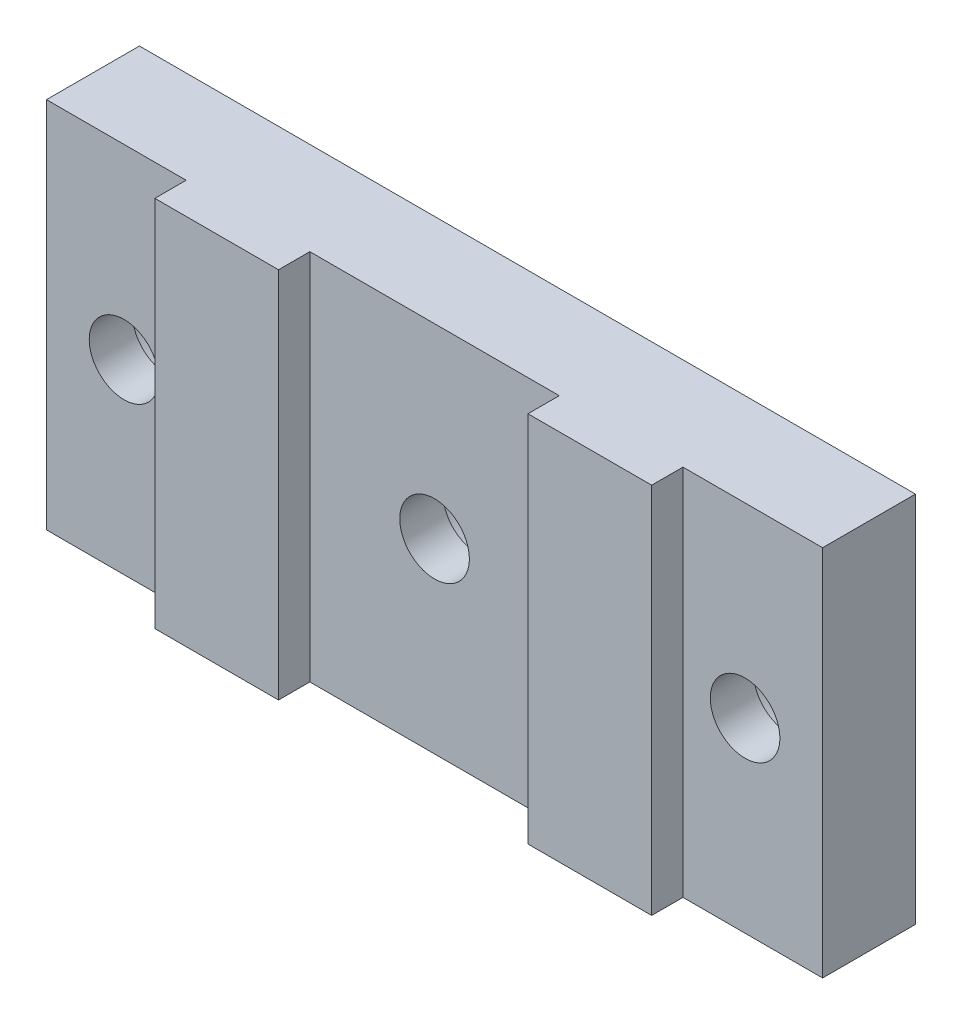
ISO-10303-21;
HEADER;
FILE_DESCRIPTION(('STEP AP214'),'2;1');
FILE_NAME('part.step','',(''),(''),'','','');
FILE_SCHEMA(('AUTOMOTIVE_DESIGN { 1 0 10303 214 1 1 1 1 }'));
ENDSEC;
DATA;
#1=APPLICATION_CONTEXT('core data for automotive mechanical design processes');
#2=APPLICATION_PROTOCOL_DEFINITION('international standard','automotive_design',2000,#1);
#3=PRODUCT_CONTEXT('',#1,'mechanical');
#4=PRODUCT('Part','Part','',(#3));
#5=PRODUCT_RELATED_PRODUCT_CATEGORY('part','',(#4));
#6=PRODUCT_DEFINITION_FORMATION('','',#4);
#7=PRODUCT_DEFINITION_CONTEXT('part definition',#1,'design');
#8=PRODUCT_DEFINITION('design','',#6,#7);
#9=PRODUCT_DEFINITION_SHAPE('','',#8);
#10=(LENGTH_UNIT() NAMED_UNIT(*) SI_UNIT(.MILLI.,.METRE.));
#11=(NAMED_UNIT(*) PLANE_ANGLE_UNIT() SI_UNIT($,.RADIAN.));
#12=(NAMED_UNIT(*) SI_UNIT($,.STERADIAN.) SOLID_ANGLE_UNIT());
#13=UNCERTAINTY_MEASURE_WITH_UNIT(LENGTH_MEASURE(1.E-05),#10,'distance_accuracy_value','');
#14=(GEOMETRIC_REPRESENTATION_CONTEXT(3) GLOBAL_UNCERTAINTY_ASSIGNED_CONTEXT((#13)) GLOBAL_UNIT_ASSIGNED_CONTEXT((#10,
#11,#12)) REPRESENTATION_CONTEXT('',''));
#15=CARTESIAN_POINT('',(0.,0.,0.));
#16=DIRECTION('',(0.,0.,1.));
#17=DIRECTION('',(1.,0.,0.));
#18=AXIS2_PLACEMENT_3D('',#15,#16,#17);
#19=CARTESIAN_POINT('',(0.,19.05,6.35));
#20=DIRECTION('',(0.,0.,-1.));
#21=DIRECTION('',(-1.,0.,0.));
#22=AXIS2_PLACEMENT_3D('',#19,#20,#21);
#23=PLANE('',#22);
#24=DIRECTION('',(1.,0.,0.));
#25=VECTOR('',#24,1.);
#26=CARTESIAN_POINT('',(0.,0.,6.35));
#27=LINE('',#26,#25);
#28=CARTESIAN_POINT('',(7.1374,0.,6.35));
#29=VERTEX_POINT('',#28);
#30=CARTESIAN_POINT('',(13.462,0.,6.35000000000003));
#31=VERTEX_POINT('',#30);
#32=EDGE_CURVE('E144',#29,#31,#27,.T.);
#33=ORIENTED_EDGE('',*,*,#32,.T.);
#34=DIRECTION('',(0.,-1.,0.));
#35=VECTOR('',#34,1.);
#36=CARTESIAN_POINT('',(13.462,19.05,6.35000000000003));
#37=LINE('',#36,#35);
#38=CARTESIAN_POINT('',(13.462,19.05,6.35000000000003));
#39=VERTEX_POINT('',#38);
#40=EDGE_CURVE('E211',#39,#31,#37,.T.);
#41=ORIENTED_EDGE('',*,*,#40,.F.);
#42=DIRECTION('',(-1.,0.,0.));
#43=VECTOR('',#42,1.);
#44=CARTESIAN_POINT('',(0.,19.05,6.35));
#45=LINE('',#44,#43);
#46=CARTESIAN_POINT('',(7.1374,19.05,6.35));
#47=VERTEX_POINT('',#46);
#48=EDGE_CURVE('E148',#39,#47,#45,.T.);
#49=ORIENTED_EDGE('',*,*,#48,.T.);
#50=DIRECTION('',(0.,-1.,0.));
#51=VECTOR('',#50,1.);
#52=CARTESIAN_POINT('',(7.1374,19.05,6.35));
#53=LINE('',#52,#51);
#54=EDGE_CURVE('E229',#47,#29,#53,.T.);
#55=ORIENTED_EDGE('',*,*,#54,.T.);
#56=EDGE_LOOP('',(#33,#41,#49,#55));
#57=FACE_BOUND('',#56,.T.);
#58=ADVANCED_FACE('F34',(#57),#23,.F.);
#59=CARTESIAN_POINT('',(0.,0.,6.35));
#60=DIRECTION('',(1.,0.,0.));
#61=DIRECTION('',(0.,0.,-1.));
#62=AXIS2_PLACEMENT_3D('',#59,#60,#61);
#63=PLANE('',#62);
#64=DIRECTION('',(0.,0.,-1.));
#65=VECTOR('',#64,1.);
#66=CARTESIAN_POINT('',(0.,0.,6.35));
#67=LINE('',#66,#65);
#68=CARTESIAN_POINT('',(0.,0.,4.7498));
#69=VERTEX_POINT('',#68);
#70=CARTESIAN_POINT('',(0.,0.,0.));
#71=VERTEX_POINT('',#70);
#72=EDGE_CURVE('E11',#69,#71,#67,.T.);
#73=ORIENTED_EDGE('',*,*,#72,.F.);
#74=DIRECTION('',(0.,-1.,0.));
#75=VECTOR('',#74,1.);
#76=CARTESIAN_POINT('',(0.,19.05,4.7498));
#77=LINE('',#76,#75);
#78=CARTESIAN_POINT('',(0.,19.05,4.7498));
#79=VERTEX_POINT('',#78);
#80=EDGE_CURVE('E228',#79,#69,#77,.T.);
#81=ORIENTED_EDGE('',*,*,#80,.F.);
#82=DIRECTION('',(0.,0.,-1.));
#83=VECTOR('',#82,1.);
#84=CARTESIAN_POINT('',(0.,19.05,6.35));
#85=LINE('',#84,#83);
#86=CARTESIAN_POINT('',(0.,19.05,0.));
#87=VERTEX_POINT('',#86);
#88=EDGE_CURVE('E156',#79,#87,#85,.T.);
#89=ORIENTED_EDGE('',*,*,#88,.T.);
#90=DIRECTION('',(0.,-1.,0.));
#91=VECTOR('',#90,1.);
#92=CARTESIAN_POINT('',(0.,0.,0.));
#93=LINE('',#92,#91);
#94=EDGE_CURVE('E232',#87,#71,#93,.T.);
#95=ORIENTED_EDGE('',*,*,#94,.T.);
#96=EDGE_LOOP('',(#73,#81,#89,#95));
#97=FACE_BOUND('',#96,.T.);
#98=ADVANCED_FACE('F36',(#97),#63,.F.);
#99=CARTESIAN_POINT('',(0.,0.,6.35));
#100=DIRECTION('',(0.,1.,0.));
#101=DIRECTION('',(0.,0.,1.));
#102=AXIS2_PLACEMENT_3D('',#99,#100,#101);
#103=PLANE('',#102);
#104=DIRECTION('',(0.,0.,-1.));
#105=VECTOR('',#104,1.);
#106=CARTESIAN_POINT('',(39.6748,0.,6.35));
#107=LINE('',#106,#105);
#108=CARTESIAN_POINT('',(39.6748,0.,4.74980000000001));
#109=VERTEX_POINT('',#108);
#110=CARTESIAN_POINT('',(39.6748,0.,0.));
#111=VERTEX_POINT('',#110);
#112=EDGE_CURVE('E43',#109,#111,#107,.T.);
#113=ORIENTED_EDGE('',*,*,#112,.F.);
#114=DIRECTION('',(1.,0.,0.));
#115=VECTOR('',#114,1.);
#116=CARTESIAN_POINT('',(39.6748,0.,4.74980000000001));
#117=LINE('',#116,#115);
#118=CARTESIAN_POINT('',(32.5374,0.,4.74980000000001));
#119=VERTEX_POINT('',#118);
#120=EDGE_CURVE('E139',#119,#109,#117,.T.);
#121=ORIENTED_EDGE('',*,*,#120,.F.);
#122=DIRECTION('',(0.,0.,-1.));
#123=VECTOR('',#122,1.);
#124=CARTESIAN_POINT('',(32.5374,0.,6.35));
#125=LINE('',#124,#123);
#126=CARTESIAN_POINT('',(32.5374,0.,6.35));
#127=VERTEX_POINT('',#126);
#128=EDGE_CURVE('E126',#127,#119,#125,.T.);
#129=ORIENTED_EDGE('',*,*,#128,.F.);
#130=CARTESIAN_POINT('',(26.2128,0.,6.35));
#131=VERTEX_POINT('',#130);
#132=EDGE_CURVE('E138',#131,#127,#27,.T.);
#133=ORIENTED_EDGE('',*,*,#132,.F.);
#134=DIRECTION('',(0.,0.,1.));
#135=VECTOR('',#134,1.);
#136=CARTESIAN_POINT('',(26.2128,0.,6.35));
#137=LINE('',#136,#135);
#138=CARTESIAN_POINT('',(26.2128,0.,4.74980000000001));
#139=VERTEX_POINT('',#138);
#140=EDGE_CURVE('E59',#139,#131,#137,.T.);
#141=ORIENTED_EDGE('',*,*,#140,.F.);
#142=DIRECTION('',(1.,0.,0.));
#143=VECTOR('',#142,1.);
#144=CARTESIAN_POINT('',(13.462,0.,4.74980000000003));
#145=LINE('',#144,#143);
#146=CARTESIAN_POINT('',(13.462,0.,4.74980000000003));
#147=VERTEX_POINT('',#146);
#148=EDGE_CURVE('E197',#147,#139,#145,.T.);
#149=ORIENTED_EDGE('',*,*,#148,.F.);
#150=DIRECTION('',(0.,0.,-1.));
#151=VECTOR('',#150,1.);
#152=CARTESIAN_POINT('',(13.462,0.,6.35000000000003));
#153=LINE('',#152,#151);
#154=EDGE_CURVE('E193',#31,#147,#153,.T.);
#155=ORIENTED_EDGE('',*,*,#154,.F.);
#156=ORIENTED_EDGE('',*,*,#32,.F.);
#157=DIRECTION('',(0.,0.,1.));
#158=VECTOR('',#157,1.);
#159=CARTESIAN_POINT('',(7.1374,0.,6.35));
#160=LINE('',#159,#158);
#161=CARTESIAN_POINT('',(7.1374,0.,4.7498));
#162=VERTEX_POINT('',#161);
#163=EDGE_CURVE('E220',#162,#29,#160,.T.);
#164=ORIENTED_EDGE('',*,*,#163,.F.);
#165=DIRECTION('',(1.,0.,0.));
#166=VECTOR('',#165,1.);
#167=CARTESIAN_POINT('',(0.,0.,4.7498));
#168=LINE('',#167,#166);
#169=EDGE_CURVE('E213',#69,#162,#168,.T.);
#170=ORIENTED_EDGE('',*,*,#169,.F.);
#171=ORIENTED_EDGE('',*,*,#72,.T.);
#172=DIRECTION('',(1.,0.,0.));
#173=VECTOR('',#172,1.);
#174=CARTESIAN_POINT('',(0.,0.,0.));
#175=LINE('',#174,#173);
#176=EDGE_CURVE('E238',#71,#111,#175,.T.);
#177=ORIENTED_EDGE('',*,*,#176,.T.);
#178=EDGE_LOOP('',(#113,#121,#129,#133,#141,#149,#155,#156,#164,#170,#171,#177));
#179=FACE_BOUND('',#178,.T.);
#180=ADVANCED_FACE('F137',(#179),#103,.F.);
#181=CARTESIAN_POINT('',(39.6748,0.,6.35));
#182=DIRECTION('',(-1.,0.,0.));
#183=DIRECTION('',(0.,0.,1.));
#184=AXIS2_PLACEMENT_3D('',#181,#182,#183);
#185=PLANE('',#184);
#186=DIRECTION('',(0.,0.,-1.));
#187=VECTOR('',#186,1.);
#188=CARTESIAN_POINT('',(39.6748,19.05,6.35));
#189=LINE('',#188,#187);
#190=CARTESIAN_POINT('',(39.6748,19.05,4.74980000000001));
#191=VERTEX_POINT('',#190);
#192=CARTESIAN_POINT('',(39.6748,19.05,0.));
#193=VERTEX_POINT('',#192);
#194=EDGE_CURVE('E158',#191,#193,#189,.T.);
#195=ORIENTED_EDGE('',*,*,#194,.F.);
#196=DIRECTION('',(0.,-1.,0.));
#197=VECTOR('',#196,1.);
#198=CARTESIAN_POINT('',(39.6748,19.05,4.74980000000001));
#199=LINE('',#198,#197);
#200=EDGE_CURVE('E190',#191,#109,#199,.T.);
#201=ORIENTED_EDGE('',*,*,#200,.T.);
#202=ORIENTED_EDGE('',*,*,#112,.T.);
#203=DIRECTION('',(0.,1.,0.));
#204=VECTOR('',#203,1.);
#205=CARTESIAN_POINT('',(39.6748,0.,0.));
#206=LINE('',#205,#204);
#207=EDGE_CURVE('E150',#111,#193,#206,.T.);
#208=ORIENTED_EDGE('',*,*,#207,.T.);
#209=EDGE_LOOP('',(#195,#201,#202,#208));
#210=FACE_BOUND('',#209,.T.);
#211=ADVANCED_FACE('F245',(#210),#185,.F.);
#212=CARTESIAN_POINT('',(0.,19.05,6.35));
#213=DIRECTION('',(0.,-1.,0.));
#214=DIRECTION('',(0.,0.,-1.));
#215=AXIS2_PLACEMENT_3D('',#212,#213,#214);
#216=PLANE('',#215);
#217=DIRECTION('',(0.,0.,-1.));
#218=VECTOR('',#217,1.);
#219=CARTESIAN_POINT('',(32.5374,19.05,6.35));
#220=LINE('',#219,#218);
#221=CARTESIAN_POINT('',(32.5374,19.05,6.35));
#222=VERTEX_POINT('',#221);
#223=CARTESIAN_POINT('',(32.5374,19.05,4.74980000000001));
#224=VERTEX_POINT('',#223);
#225=EDGE_CURVE('E51',#222,#224,#220,.T.);
#226=ORIENTED_EDGE('',*,*,#225,.T.);
#227=DIRECTION('',(1.,0.,0.));
#228=VECTOR('',#227,1.);
#229=CARTESIAN_POINT('',(39.6748,19.05,4.74980000000001));
#230=LINE('',#229,#228);
#231=EDGE_CURVE('E132',#224,#191,#230,.T.);
#232=ORIENTED_EDGE('',*,*,#231,.T.);
#233=ORIENTED_EDGE('',*,*,#194,.T.);
#234=DIRECTION('',(-1.,0.,0.));
#235=VECTOR('',#234,1.);
#236=CARTESIAN_POINT('',(0.,19.05,0.));
#237=LINE('',#236,#235);
#238=EDGE_CURVE('E145',#193,#87,#237,.T.);
#239=ORIENTED_EDGE('',*,*,#238,.T.);
#240=ORIENTED_EDGE('',*,*,#88,.F.);
#241=DIRECTION('',(1.,0.,0.));
#242=VECTOR('',#241,1.);
#243=CARTESIAN_POINT('',(0.,19.05,4.7498));
#244=LINE('',#243,#242);
#245=CARTESIAN_POINT('',(7.1374,19.05,4.7498));
#246=VERTEX_POINT('',#245);
#247=EDGE_CURVE('E222',#79,#246,#244,.T.);
#248=ORIENTED_EDGE('',*,*,#247,.T.);
#249=DIRECTION('',(0.,0.,1.));
#250=VECTOR('',#249,1.);
#251=CARTESIAN_POINT('',(7.1374,19.05,6.35));
#252=LINE('',#251,#250);
#253=EDGE_CURVE('E225',#246,#47,#252,.T.);
#254=ORIENTED_EDGE('',*,*,#253,.T.);
#255=ORIENTED_EDGE('',*,*,#48,.F.);
#256=DIRECTION('',(0.,0.,-1.));
#257=VECTOR('',#256,1.);
#258=CARTESIAN_POINT('',(13.462,19.05,6.35000000000003));
#259=LINE('',#258,#257);
#260=CARTESIAN_POINT('',(13.462,19.05,4.74980000000003));
#261=VERTEX_POINT('',#260);
#262=EDGE_CURVE('E201',#39,#261,#259,.T.);
#263=ORIENTED_EDGE('',*,*,#262,.T.);
#264=DIRECTION('',(1.,0.,0.));
#265=VECTOR('',#264,1.);
#266=CARTESIAN_POINT('',(13.462,19.05,4.74980000000003));
#267=LINE('',#266,#265);
#268=CARTESIAN_POINT('',(26.2128,19.05,4.74980000000001));
#269=VERTEX_POINT('',#268);
#270=EDGE_CURVE('E204',#261,#269,#267,.T.);
#271=ORIENTED_EDGE('',*,*,#270,.T.);
#272=DIRECTION('',(0.,0.,1.));
#273=VECTOR('',#272,1.);
#274=CARTESIAN_POINT('',(26.2128,19.05,6.35));
#275=LINE('',#274,#273);
#276=CARTESIAN_POINT('',(26.2128,19.05,6.35));
#277=VERTEX_POINT('',#276);
#278=EDGE_CURVE('E207',#269,#277,#275,.T.);
#279=ORIENTED_EDGE('',*,*,#278,.T.);
#280=EDGE_CURVE('E154',#222,#277,#45,.T.);
#281=ORIENTED_EDGE('',*,*,#280,.F.);
#282=EDGE_LOOP('',(#226,#232,#233,#239,#240,#248,#254,#255,#263,#271,#279,#281));
#283=FACE_BOUND('',#282,.T.);
#284=ADVANCED_FACE('F252',(#283),#216,.F.);
#285=ORIENTED_EDGE('',*,*,#132,.T.);
#286=DIRECTION('',(0.,-1.,0.));
#287=VECTOR('',#286,1.);
#288=CARTESIAN_POINT('',(32.5374,19.05,6.35));
#289=LINE('',#288,#287);
#290=EDGE_CURVE('E123',#222,#127,#289,.T.);
#291=ORIENTED_EDGE('',*,*,#290,.F.);
#292=ORIENTED_EDGE('',*,*,#280,.T.);
#293=DIRECTION('',(0.,-1.,0.));
#294=VECTOR('',#293,1.);
#295=CARTESIAN_POINT('',(26.2128,19.05,6.35));
#296=LINE('',#295,#294);
#297=EDGE_CURVE('E143',#277,#131,#296,.T.);
#298=ORIENTED_EDGE('',*,*,#297,.T.);
#299=EDGE_LOOP('',(#285,#291,#292,#298));
#300=FACE_BOUND('',#299,.T.);
#301=ADVANCED_FACE('F142',(#300),#23,.F.);
#302=CARTESIAN_POINT('',(0.,19.05,0.));
#303=DIRECTION('',(0.,0.,-1.));
#304=DIRECTION('',(-1.,0.,0.));
#305=AXIS2_PLACEMENT_3D('',#302,#303,#304);
#306=PLANE('',#305);
#307=CARTESIAN_POINT('',(3.9624,9.525,0.));
#308=DIRECTION('',(0.,0.,-1.));
#309=DIRECTION('',(-1.,0.,0.));
#310=AXIS2_PLACEMENT_3D('',#307,#308,#309);
#311=CIRCLE('',#310,3.17500000000001);
#312=CARTESIAN_POINT('',(0.787399999999983,9.525,0.));
#313=VERTEX_POINT('',#312);
#314=EDGE_CURVE('E478',#313,#313,#311,.T.);
#315=ORIENTED_EDGE('',*,*,#314,.F.);
#316=EDGE_LOOP('',(#315));
#317=FACE_BOUND('',#316,.T.);
#318=CARTESIAN_POINT('',(19.8374,9.525,0.));
#319=DIRECTION('',(0.,0.,-1.));
#320=DIRECTION('',(-1.,0.,0.));
#321=AXIS2_PLACEMENT_3D('',#318,#319,#320);
#322=CIRCLE('',#321,3.17500000000001);
#323=CARTESIAN_POINT('',(16.6624,9.525,0.));
#324=VERTEX_POINT('',#323);
#325=EDGE_CURVE('E178',#324,#324,#322,.T.);
#326=ORIENTED_EDGE('',*,*,#325,.F.);
#327=EDGE_LOOP('',(#326));
#328=FACE_BOUND('',#327,.T.);
#329=CARTESIAN_POINT('',(35.7124,9.525,0.));
#330=DIRECTION('',(0.,0.,-1.));
#331=DIRECTION('',(-1.,0.,0.));
#332=AXIS2_PLACEMENT_3D('',#329,#330,#331);
#333=CIRCLE('',#332,3.17500000000002);
#334=CARTESIAN_POINT('',(32.5374,9.525,0.));
#335=VERTEX_POINT('',#334);
#336=EDGE_CURVE('E165',#335,#335,#333,.T.);
#337=ORIENTED_EDGE('',*,*,#336,.F.);
#338=EDGE_LOOP('',(#337));
#339=FACE_BOUND('',#338,.T.);
#340=ORIENTED_EDGE('',*,*,#94,.F.);
#341=ORIENTED_EDGE('',*,*,#238,.F.);
#342=ORIENTED_EDGE('',*,*,#207,.F.);
#343=ORIENTED_EDGE('',*,*,#176,.F.);
#344=EDGE_LOOP('',(#340,#341,#342,#343));
#345=FACE_BOUND('',#344,.T.);
#346=ADVANCED_FACE('F249',(#317,#328,#339,#345),#306,.T.);
#347=CARTESIAN_POINT('',(7.1374,19.05,6.35));
#348=DIRECTION('',(1.,0.,0.));
#349=DIRECTION('',(0.,0.,-1.));
#350=AXIS2_PLACEMENT_3D('',#347,#348,#349);
#351=PLANE('',#350);
#352=ORIENTED_EDGE('',*,*,#163,.T.);
#353=ORIENTED_EDGE('',*,*,#54,.F.);
#354=ORIENTED_EDGE('',*,*,#253,.F.);
#355=DIRECTION('',(0.,-1.,0.));
#356=VECTOR('',#355,1.);
#357=CARTESIAN_POINT('',(7.1374,19.05,4.7498));
#358=LINE('',#357,#356);
#359=EDGE_CURVE('E233',#246,#162,#358,.T.);
#360=ORIENTED_EDGE('',*,*,#359,.T.);
#361=EDGE_LOOP('',(#352,#353,#354,#360));
#362=FACE_BOUND('',#361,.T.);
#363=ADVANCED_FACE('F267',(#362),#351,.F.);
#364=CARTESIAN_POINT('',(0.,19.05,4.7498));
#365=DIRECTION('',(0.,0.,-1.));
#366=DIRECTION('',(-1.,0.,0.));
#367=AXIS2_PLACEMENT_3D('',#364,#365,#366);
#368=PLANE('',#367);
#369=CARTESIAN_POINT('',(3.9624,9.525,4.7498));
#370=DIRECTION('',(0.,0.,-1.));
#371=DIRECTION('',(-1.,0.,0.));
#372=AXIS2_PLACEMENT_3D('',#369,#370,#371);
#373=CIRCLE('',#372,1.77800000000001);
#374=CARTESIAN_POINT('',(2.18439999999999,9.525,4.7498));
#375=VERTEX_POINT('',#374);
#376=EDGE_CURVE('E38',#375,#375,#373,.T.);
#377=ORIENTED_EDGE('',*,*,#376,.T.);
#378=EDGE_LOOP('',(#377));
#379=FACE_BOUND('',#378,.T.);
#380=ORIENTED_EDGE('',*,*,#169,.T.);
#381=ORIENTED_EDGE('',*,*,#359,.F.);
#382=ORIENTED_EDGE('',*,*,#247,.F.);
#383=ORIENTED_EDGE('',*,*,#80,.T.);
#384=EDGE_LOOP('',(#380,#381,#382,#383));
#385=FACE_BOUND('',#384,.T.);
#386=ADVANCED_FACE('F261',(#379,#385),#368,.F.);
#387=CARTESIAN_POINT('',(13.462,19.05,6.35000000000003));
#388=DIRECTION('',(-1.,0.,0.));
#389=DIRECTION('',(0.,0.,1.));
#390=AXIS2_PLACEMENT_3D('',#387,#388,#389);
#391=PLANE('',#390);
#392=ORIENTED_EDGE('',*,*,#154,.T.);
#393=DIRECTION('',(0.,-1.,0.));
#394=VECTOR('',#393,1.);
#395=CARTESIAN_POINT('',(13.462,19.05,4.74980000000003));
#396=LINE('',#395,#394);
#397=EDGE_CURVE('E210',#261,#147,#396,.T.);
#398=ORIENTED_EDGE('',*,*,#397,.F.);
#399=ORIENTED_EDGE('',*,*,#262,.F.);
#400=ORIENTED_EDGE('',*,*,#40,.T.);
#401=EDGE_LOOP('',(#392,#398,#399,#400));
#402=FACE_BOUND('',#401,.T.);
#403=ADVANCED_FACE('F274',(#402),#391,.F.);
#404=CARTESIAN_POINT('',(26.2128,19.05,6.35));
#405=DIRECTION('',(1.,0.,0.));
#406=DIRECTION('',(0.,0.,-1.));
#407=AXIS2_PLACEMENT_3D('',#404,#405,#406);
#408=PLANE('',#407);
#409=ORIENTED_EDGE('',*,*,#140,.T.);
#410=ORIENTED_EDGE('',*,*,#297,.F.);
#411=ORIENTED_EDGE('',*,*,#278,.F.);
#412=DIRECTION('',(0.,-1.,0.));
#413=VECTOR('',#412,1.);
#414=CARTESIAN_POINT('',(26.2128,19.05,4.74980000000001));
#415=LINE('',#414,#413);
#416=EDGE_CURVE('E215',#269,#139,#415,.T.);
#417=ORIENTED_EDGE('',*,*,#416,.T.);
#418=EDGE_LOOP('',(#409,#410,#411,#417));
#419=FACE_BOUND('',#418,.T.);
#420=ADVANCED_FACE('F279',(#419),#408,.F.);
#421=CARTESIAN_POINT('',(13.462,19.05,4.74980000000003));
#422=DIRECTION('',(0.,0.,-1.));
#423=DIRECTION('',(-1.,0.,0.));
#424=AXIS2_PLACEMENT_3D('',#421,#422,#423);
#425=PLANE('',#424);
#426=CARTESIAN_POINT('',(19.8374,9.525,4.74980000000003));
#427=DIRECTION('',(0.,0.,-1.));
#428=DIRECTION('',(-1.,0.,0.));
#429=AXIS2_PLACEMENT_3D('',#426,#427,#428);
#430=CIRCLE('',#429,1.77800000000001);
#431=CARTESIAN_POINT('',(18.0594,9.525,4.74980000000003));
#432=VERTEX_POINT('',#431);
#433=EDGE_CURVE('E163',#432,#432,#430,.T.);
#434=ORIENTED_EDGE('',*,*,#433,.T.);
#435=EDGE_LOOP('',(#434));
#436=FACE_BOUND('',#435,.T.);
#437=ORIENTED_EDGE('',*,*,#148,.T.);
#438=ORIENTED_EDGE('',*,*,#416,.F.);
#439=ORIENTED_EDGE('',*,*,#270,.F.);
#440=ORIENTED_EDGE('',*,*,#397,.T.);
#441=EDGE_LOOP('',(#437,#438,#439,#440));
#442=FACE_BOUND('',#441,.T.);
#443=ADVANCED_FACE('F277',(#436,#442),#425,.F.);
#444=CARTESIAN_POINT('',(39.6748,19.05,4.74980000000001));
#445=DIRECTION('',(0.,0.,-1.));
#446=DIRECTION('',(-1.,0.,0.));
#447=AXIS2_PLACEMENT_3D('',#444,#445,#446);
#448=PLANE('',#447);
#449=CARTESIAN_POINT('',(35.7124,9.525,4.74980000000001));
#450=DIRECTION('',(0.,0.,-1.));
#451=DIRECTION('',(-1.,0.,0.));
#452=AXIS2_PLACEMENT_3D('',#449,#450,#451);
#453=CIRCLE('',#452,1.77800000000001);
#454=CARTESIAN_POINT('',(33.9344,9.525,4.74980000000001));
#455=VERTEX_POINT('',#454);
#456=EDGE_CURVE('E140',#455,#455,#453,.T.);
#457=ORIENTED_EDGE('',*,*,#456,.T.);
#458=EDGE_LOOP('',(#457));
#459=FACE_BOUND('',#458,.T.);
#460=ORIENTED_EDGE('',*,*,#120,.T.);
#461=ORIENTED_EDGE('',*,*,#200,.F.);
#462=ORIENTED_EDGE('',*,*,#231,.F.);
#463=DIRECTION('',(0.,-1.,0.));
#464=VECTOR('',#463,1.);
#465=CARTESIAN_POINT('',(32.5374,19.05,4.74980000000001));
#466=LINE('',#465,#464);
#467=EDGE_CURVE('E131',#224,#119,#466,.T.);
#468=ORIENTED_EDGE('',*,*,#467,.T.);
#469=EDGE_LOOP('',(#460,#461,#462,#468));
#470=FACE_BOUND('',#469,.T.);
#471=ADVANCED_FACE('F255',(#459,#470),#448,.F.);
#472=CARTESIAN_POINT('',(32.5374,19.05,6.35));
#473=DIRECTION('',(-1.,0.,0.));
#474=DIRECTION('',(0.,0.,1.));
#475=AXIS2_PLACEMENT_3D('',#472,#473,#474);
#476=PLANE('',#475);
#477=ORIENTED_EDGE('',*,*,#128,.T.);
#478=ORIENTED_EDGE('',*,*,#467,.F.);
#479=ORIENTED_EDGE('',*,*,#225,.F.);
#480=ORIENTED_EDGE('',*,*,#290,.T.);
#481=EDGE_LOOP('',(#477,#478,#479,#480));
#482=FACE_BOUND('',#481,.T.);
#483=ADVANCED_FACE('F125',(#482),#476,.F.);
#484=CARTESIAN_POINT('',(35.7124,9.525,0.));
#485=DIRECTION('',(0.,0.,-1.));
#486=DIRECTION('',(-1.,0.,0.));
#487=AXIS2_PLACEMENT_3D('',#484,#485,#486);
#488=CYLINDRICAL_SURFACE('',#487,1.77800000000001);
#489=CARTESIAN_POINT('',(35.7124,9.525,2.54));
#490=DIRECTION('',(0.,0.,-1.));
#491=DIRECTION('',(-1.,0.,0.));
#492=AXIS2_PLACEMENT_3D('',#489,#490,#491);
#493=CIRCLE('',#492,1.77800000000002);
#494=CARTESIAN_POINT('',(33.9344,9.525,2.54));
#495=VERTEX_POINT('',#494);
#496=EDGE_CURVE('E162',#495,#495,#493,.T.);
#497=ORIENTED_EDGE('',*,*,#496,.T.);
#498=EDGE_LOOP('',(#497));
#499=FACE_BOUND('',#498,.T.);
#500=ORIENTED_EDGE('',*,*,#456,.F.);
#501=EDGE_LOOP('',(#500));
#502=FACE_BOUND('',#501,.T.);
#503=ADVANCED_FACE('F381',(#499,#502),#488,.F.);
#504=CARTESIAN_POINT('',(37.4904,9.525,2.54));
#505=DIRECTION('',(0.,0.,1.));
#506=DIRECTION('',(1.,0.,0.));
#507=AXIS2_PLACEMENT_3D('',#504,#505,#506);
#508=PLANE('',#507);
#509=ORIENTED_EDGE('',*,*,#496,.F.);
#510=EDGE_LOOP('',(#509));
#511=FACE_BOUND('',#510,.T.);
#512=CARTESIAN_POINT('',(35.7124,9.525,2.54));
#513=DIRECTION('',(0.,0.,-1.));
#514=DIRECTION('',(-1.,0.,0.));
#515=AXIS2_PLACEMENT_3D('',#512,#513,#514);
#516=CIRCLE('',#515,3.17500000000001);
#517=CARTESIAN_POINT('',(32.5374,9.525,2.54));
#518=VERTEX_POINT('',#517);
#519=EDGE_CURVE('E170',#518,#518,#516,.T.);
#520=ORIENTED_EDGE('',*,*,#519,.T.);
#521=EDGE_LOOP('',(#520));
#522=FACE_BOUND('',#521,.T.);
#523=ADVANCED_FACE('F389',(#511,#522),#508,.F.);
#524=CARTESIAN_POINT('',(35.7124,9.525,0.));
#525=DIRECTION('',(0.,0.,-1.));
#526=DIRECTION('',(-1.,0.,0.));
#527=AXIS2_PLACEMENT_3D('',#524,#525,#526);
#528=CYLINDRICAL_SURFACE('',#527,3.17500000000001);
#529=ORIENTED_EDGE('',*,*,#519,.F.);
#530=EDGE_LOOP('',(#529));
#531=FACE_BOUND('',#530,.T.);
#532=ORIENTED_EDGE('',*,*,#336,.T.);
#533=EDGE_LOOP('',(#532));
#534=FACE_BOUND('',#533,.T.);
#535=ADVANCED_FACE('F399',(#531,#534),#528,.F.);
#536=CARTESIAN_POINT('',(19.8374,9.525,0.));
#537=DIRECTION('',(0.,0.,-1.));
#538=DIRECTION('',(-1.,0.,0.));
#539=AXIS2_PLACEMENT_3D('',#536,#537,#538);
#540=CYLINDRICAL_SURFACE('',#539,1.77800000000001);
#541=CARTESIAN_POINT('',(19.8374,9.525,2.54000000000004));
#542=DIRECTION('',(0.,0.,-1.));
#543=DIRECTION('',(-1.,0.,0.));
#544=AXIS2_PLACEMENT_3D('',#541,#542,#543);
#545=CIRCLE('',#544,1.77800000000001);
#546=CARTESIAN_POINT('',(18.0594,9.525,2.54000000000004));
#547=VERTEX_POINT('',#546);
#548=EDGE_CURVE('E166',#547,#547,#545,.T.);
#549=ORIENTED_EDGE('',*,*,#548,.T.);
#550=EDGE_LOOP('',(#549));
#551=FACE_BOUND('',#550,.T.);
#552=ORIENTED_EDGE('',*,*,#433,.F.);
#553=EDGE_LOOP('',(#552));
#554=FACE_BOUND('',#553,.T.);
#555=ADVANCED_FACE('F409',(#551,#554),#540,.F.);
#556=CARTESIAN_POINT('',(21.6154,9.525,2.54000000000004));
#557=DIRECTION('',(0.,0.,1.));
#558=DIRECTION('',(1.,0.,0.));
#559=AXIS2_PLACEMENT_3D('',#556,#557,#558);
#560=PLANE('',#559);
#561=ORIENTED_EDGE('',*,*,#548,.F.);
#562=EDGE_LOOP('',(#561));
#563=FACE_BOUND('',#562,.T.);
#564=CARTESIAN_POINT('',(19.8374,9.525,2.54000000000004));
#565=DIRECTION('',(0.,0.,-1.));
#566=DIRECTION('',(-1.,0.,0.));
#567=AXIS2_PLACEMENT_3D('',#564,#565,#566);
#568=CIRCLE('',#567,3.17500000000001);
#569=CARTESIAN_POINT('',(16.6624,9.525,2.54000000000004));
#570=VERTEX_POINT('',#569);
#571=EDGE_CURVE('E173',#570,#570,#568,.T.);
#572=ORIENTED_EDGE('',*,*,#571,.T.);
#573=EDGE_LOOP('',(#572));
#574=FACE_BOUND('',#573,.T.);
#575=ADVANCED_FACE('F419',(#563,#574),#560,.F.);
#576=CARTESIAN_POINT('',(19.8374,9.525,0.));
#577=DIRECTION('',(0.,0.,-1.));
#578=DIRECTION('',(-1.,0.,0.));
#579=AXIS2_PLACEMENT_3D('',#576,#577,#578);
#580=CYLINDRICAL_SURFACE('',#579,3.17500000000001);
#581=ORIENTED_EDGE('',*,*,#571,.F.);
#582=EDGE_LOOP('',(#581));
#583=FACE_BOUND('',#582,.T.);
#584=ORIENTED_EDGE('',*,*,#325,.T.);
#585=EDGE_LOOP('',(#584));
#586=FACE_BOUND('',#585,.T.);
#587=ADVANCED_FACE('F428',(#583,#586),#580,.F.);
#588=CARTESIAN_POINT('',(3.9624,9.525,0.));
#589=DIRECTION('',(0.,0.,-1.));
#590=DIRECTION('',(-1.,0.,0.));
#591=AXIS2_PLACEMENT_3D('',#588,#589,#590);
#592=CYLINDRICAL_SURFACE('',#591,1.77800000000001);
#593=CARTESIAN_POINT('',(3.9624,9.525,2.54));
#594=DIRECTION('',(0.,0.,-1.));
#595=DIRECTION('',(-1.,0.,0.));
#596=AXIS2_PLACEMENT_3D('',#593,#594,#595);
#597=CIRCLE('',#596,1.77800000000001);
#598=CARTESIAN_POINT('',(2.18439999999998,9.525,2.54));
#599=VERTEX_POINT('',#598);
#600=EDGE_CURVE('E480',#599,#599,#597,.T.);
#601=ORIENTED_EDGE('',*,*,#600,.T.);
#602=EDGE_LOOP('',(#601));
#603=FACE_BOUND('',#602,.T.);
#604=ORIENTED_EDGE('',*,*,#376,.F.);
#605=EDGE_LOOP('',(#604));
#606=FACE_BOUND('',#605,.T.);
#607=ADVANCED_FACE('F438',(#603,#606),#592,.F.);
#608=CARTESIAN_POINT('',(5.74040000000001,9.525,2.54));
#609=DIRECTION('',(0.,0.,1.));
#610=DIRECTION('',(1.,0.,0.));
#611=AXIS2_PLACEMENT_3D('',#608,#609,#610);
#612=PLANE('',#611);
#613=ORIENTED_EDGE('',*,*,#600,.F.);
#614=EDGE_LOOP('',(#613));
#615=FACE_BOUND('',#614,.T.);
#616=CARTESIAN_POINT('',(3.9624,9.525,2.54));
#617=DIRECTION('',(0.,0.,-1.));
#618=DIRECTION('',(-1.,0.,0.));
#619=AXIS2_PLACEMENT_3D('',#616,#617,#618);
#620=CIRCLE('',#619,3.17500000000001);
#621=CARTESIAN_POINT('',(0.787399999999985,9.525,2.54));
#622=VERTEX_POINT('',#621);
#623=EDGE_CURVE('E475',#622,#622,#620,.T.);
#624=ORIENTED_EDGE('',*,*,#623,.T.);
#625=EDGE_LOOP('',(#624));
#626=FACE_BOUND('',#625,.T.);
#627=ADVANCED_FACE('F448',(#615,#626),#612,.F.);
#628=CARTESIAN_POINT('',(3.9624,9.525,0.));
#629=DIRECTION('',(0.,0.,-1.));
#630=DIRECTION('',(-1.,0.,0.));
#631=AXIS2_PLACEMENT_3D('',#628,#629,#630);
#632=CYLINDRICAL_SURFACE('',#631,3.17500000000001);
#633=ORIENTED_EDGE('',*,*,#623,.F.);
#634=EDGE_LOOP('',(#633));
#635=FACE_BOUND('',#634,.T.);
#636=ORIENTED_EDGE('',*,*,#314,.T.);
#637=EDGE_LOOP('',(#636));
#638=FACE_BOUND('',#637,.T.);
#639=ADVANCED_FACE('F458',(#635,#638),#632,.F.);
#640=CLOSED_SHELL('',(#58,#98,#180,#211,#284,#301,#346,#363,#386,#403,#420,#443,#471,#483,#503,
#523,#535,#555,#575,#587,#607,#627,#639));
#641=MANIFOLD_SOLID_BREP('B2',#640);
#642=ADVANCED_BREP_SHAPE_REPRESENTATION('',(#18,#641),#14);
#643=SHAPE_DEFINITION_REPRESENTATION(#9,#642);
ENDSEC;
END-ISO-10303-21;
